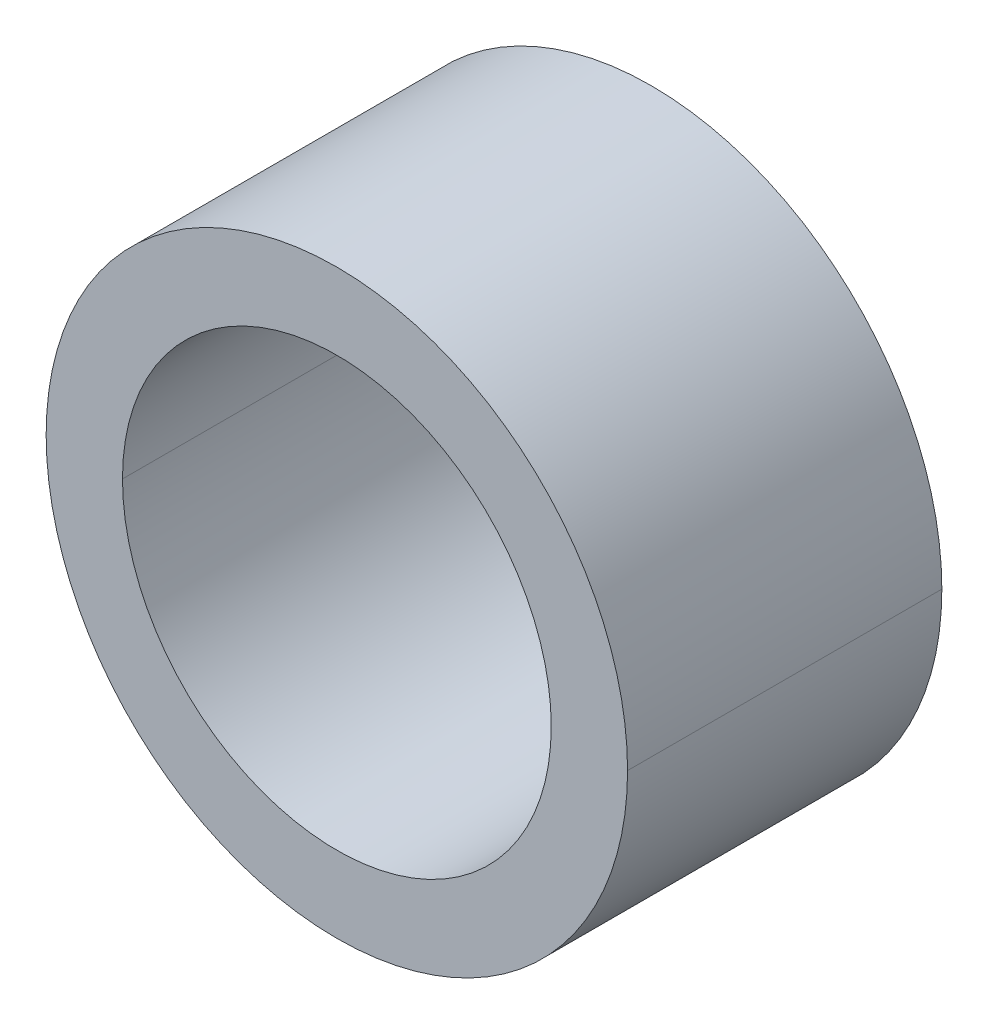
ISO-10303-21;
HEADER;
FILE_DESCRIPTION(('STEP AP214'),'2;1');
FILE_NAME('part.step','',(''),(''),'','','');
FILE_SCHEMA(('AUTOMOTIVE_DESIGN { 1 0 10303 214 1 1 1 1 }'));
ENDSEC;
DATA;
#1=APPLICATION_CONTEXT('core data for automotive mechanical design processes');
#2=APPLICATION_PROTOCOL_DEFINITION('international standard','automotive_design',2000,#1);
#3=PRODUCT_CONTEXT('',#1,'mechanical');
#4=PRODUCT('Part','Part','',(#3));
#5=PRODUCT_RELATED_PRODUCT_CATEGORY('part','',(#4));
#6=PRODUCT_DEFINITION_FORMATION('','',#4);
#7=PRODUCT_DEFINITION_CONTEXT('part definition',#1,'design');
#8=PRODUCT_DEFINITION('design','',#6,#7);
#9=PRODUCT_DEFINITION_SHAPE('','',#8);
#10=(LENGTH_UNIT() NAMED_UNIT(*) SI_UNIT(.MILLI.,.METRE.));
#11=(NAMED_UNIT(*) PLANE_ANGLE_UNIT() SI_UNIT($,.RADIAN.));
#12=(NAMED_UNIT(*) SI_UNIT($,.STERADIAN.) SOLID_ANGLE_UNIT());
#13=UNCERTAINTY_MEASURE_WITH_UNIT(LENGTH_MEASURE(1.E-05),#10,'distance_accuracy_value','');
#14=(GEOMETRIC_REPRESENTATION_CONTEXT(3) GLOBAL_UNCERTAINTY_ASSIGNED_CONTEXT((#13)) GLOBAL_UNIT_ASSIGNED_CONTEXT((#10,
#11,#12)) REPRESENTATION_CONTEXT('',''));
#15=CARTESIAN_POINT('',(0.,0.,0.));
#16=DIRECTION('',(0.,0.,1.));
#17=DIRECTION('',(1.,0.,0.));
#18=AXIS2_PLACEMENT_3D('',#15,#16,#17);
#19=CARTESIAN_POINT('',(0.,0.,7.112));
#20=DIRECTION('',(0.,0.,-1.));
#21=DIRECTION('',(-1.,0.,0.));
#22=AXIS2_PLACEMENT_3D('',#19,#20,#21);
#23=CYLINDRICAL_SURFACE('',#22,4.8514);
#24=DIRECTION('',(0.,0.,-1.));
#25=VECTOR('',#24,1.);
#26=CARTESIAN_POINT('',(4.8514,0.,7.112));
#27=LINE('',#26,#25);
#28=CARTESIAN_POINT('',(4.8514,0.,7.112));
#29=VERTEX_POINT('',#28);
#30=CARTESIAN_POINT('',(4.8514,0.,0.));
#31=VERTEX_POINT('',#30);
#32=EDGE_CURVE('E80',#29,#31,#27,.T.);
#33=ORIENTED_EDGE('',*,*,#32,.F.);
#34=CARTESIAN_POINT('',(0.,0.,7.112));
#35=DIRECTION('',(0.,0.,1.));
#36=DIRECTION('',(1.,0.,0.));
#37=AXIS2_PLACEMENT_3D('',#34,#35,#36);
#38=CIRCLE('',#37,4.8514);
#39=CARTESIAN_POINT('',(-4.8514,0.,7.112));
#40=VERTEX_POINT('',#39);
#41=EDGE_CURVE('E71',#29,#40,#38,.T.);
#42=ORIENTED_EDGE('',*,*,#41,.T.);
#43=DIRECTION('',(0.,0.,-1.));
#44=VECTOR('',#43,1.);
#45=CARTESIAN_POINT('',(-4.8514,0.,7.112));
#46=LINE('',#45,#44);
#47=CARTESIAN_POINT('',(-4.8514,0.,0.));
#48=VERTEX_POINT('',#47);
#49=EDGE_CURVE('E72',#40,#48,#46,.T.);
#50=ORIENTED_EDGE('',*,*,#49,.T.);
#51=CARTESIAN_POINT('',(0.,0.,0.));
#52=DIRECTION('',(0.,0.,1.));
#53=DIRECTION('',(1.,0.,0.));
#54=AXIS2_PLACEMENT_3D('',#51,#52,#53);
#55=CIRCLE('',#54,4.8514);
#56=EDGE_CURVE('E11',#31,#48,#55,.T.);
#57=ORIENTED_EDGE('',*,*,#56,.F.);
#58=EDGE_LOOP('',(#33,#42,#50,#57));
#59=FACE_BOUND('',#58,.T.);
#60=ADVANCED_FACE('F16',(#59),#23,.F.);
#61=CARTESIAN_POINT('',(0.,0.,7.112));
#62=DIRECTION('',(0.,0.,-1.));
#63=DIRECTION('',(-1.,0.,0.));
#64=AXIS2_PLACEMENT_3D('',#61,#62,#63);
#65=CYLINDRICAL_SURFACE('',#64,6.5786);
#66=DIRECTION('',(0.,0.,-1.));
#67=VECTOR('',#66,1.);
#68=CARTESIAN_POINT('',(6.5786,0.,7.112));
#69=LINE('',#68,#67);
#70=CARTESIAN_POINT('',(6.5786,0.,7.112));
#71=VERTEX_POINT('',#70);
#72=CARTESIAN_POINT('',(6.5786,0.,0.));
#73=VERTEX_POINT('',#72);
#74=EDGE_CURVE('E103',#71,#73,#69,.T.);
#75=ORIENTED_EDGE('',*,*,#74,.F.);
#76=CARTESIAN_POINT('',(0.,0.,7.112));
#77=DIRECTION('',(0.,0.,1.));
#78=DIRECTION('',(1.,0.,0.));
#79=AXIS2_PLACEMENT_3D('',#76,#77,#78);
#80=CIRCLE('',#79,6.5786);
#81=CARTESIAN_POINT('',(-6.5786,0.,7.112));
#82=VERTEX_POINT('',#81);
#83=EDGE_CURVE('E19',#82,#71,#80,.T.);
#84=ORIENTED_EDGE('',*,*,#83,.F.);
#85=DIRECTION('',(0.,0.,-1.));
#86=VECTOR('',#85,1.);
#87=CARTESIAN_POINT('',(-6.5786,0.,7.112));
#88=LINE('',#87,#86);
#89=CARTESIAN_POINT('',(-6.5786,0.,0.));
#90=VERTEX_POINT('',#89);
#91=EDGE_CURVE('E113',#82,#90,#88,.T.);
#92=ORIENTED_EDGE('',*,*,#91,.T.);
#93=CARTESIAN_POINT('',(0.,0.,0.));
#94=DIRECTION('',(0.,0.,1.));
#95=DIRECTION('',(1.,0.,0.));
#96=AXIS2_PLACEMENT_3D('',#93,#94,#95);
#97=CIRCLE('',#96,6.5786);
#98=EDGE_CURVE('E25',#90,#73,#97,.T.);
#99=ORIENTED_EDGE('',*,*,#98,.T.);
#100=EDGE_LOOP('',(#75,#84,#92,#99));
#101=FACE_BOUND('',#100,.T.);
#102=ADVANCED_FACE('F121',(#101),#65,.T.);
#103=CARTESIAN_POINT('',(0.,0.,0.));
#104=DIRECTION('',(0.,0.,1.));
#105=DIRECTION('',(1.,0.,0.));
#106=AXIS2_PLACEMENT_3D('',#103,#104,#105);
#107=PLANE('',#106);
#108=CARTESIAN_POINT('',(0.,0.,0.));
#109=DIRECTION('',(0.,0.,1.));
#110=DIRECTION('',(1.,0.,0.));
#111=AXIS2_PLACEMENT_3D('',#108,#109,#110);
#112=CIRCLE('',#111,4.8514);
#113=EDGE_CURVE('E87',#48,#31,#112,.T.);
#114=ORIENTED_EDGE('',*,*,#113,.T.);
#115=ORIENTED_EDGE('',*,*,#56,.T.);
#116=EDGE_LOOP('',(#114,#115));
#117=FACE_BOUND('',#116,.T.);
#118=ORIENTED_EDGE('',*,*,#98,.F.);
#119=CARTESIAN_POINT('',(0.,0.,0.));
#120=DIRECTION('',(0.,0.,1.));
#121=DIRECTION('',(1.,0.,0.));
#122=AXIS2_PLACEMENT_3D('',#119,#120,#121);
#123=CIRCLE('',#122,6.5786);
#124=EDGE_CURVE('E110',#73,#90,#123,.T.);
#125=ORIENTED_EDGE('',*,*,#124,.F.);
#126=EDGE_LOOP('',(#118,#125));
#127=FACE_BOUND('',#126,.T.);
#128=ADVANCED_FACE('F126',(#117,#127),#107,.F.);
#129=CARTESIAN_POINT('',(0.,0.,7.112));
#130=DIRECTION('',(0.,0.,1.));
#131=DIRECTION('',(1.,0.,0.));
#132=AXIS2_PLACEMENT_3D('',#129,#130,#131);
#133=PLANE('',#132);
#134=CARTESIAN_POINT('',(0.,0.,7.112));
#135=DIRECTION('',(0.,0.,1.));
#136=DIRECTION('',(1.,0.,0.));
#137=AXIS2_PLACEMENT_3D('',#134,#135,#136);
#138=CIRCLE('',#137,4.8514);
#139=EDGE_CURVE('E83',#40,#29,#138,.T.);
#140=ORIENTED_EDGE('',*,*,#139,.F.);
#141=ORIENTED_EDGE('',*,*,#41,.F.);
#142=EDGE_LOOP('',(#140,#141));
#143=FACE_BOUND('',#142,.T.);
#144=ORIENTED_EDGE('',*,*,#83,.T.);
#145=CARTESIAN_POINT('',(0.,0.,7.112));
#146=DIRECTION('',(0.,0.,1.));
#147=DIRECTION('',(1.,0.,0.));
#148=AXIS2_PLACEMENT_3D('',#145,#146,#147);
#149=CIRCLE('',#148,6.5786);
#150=EDGE_CURVE('E90',#71,#82,#149,.T.);
#151=ORIENTED_EDGE('',*,*,#150,.T.);
#152=EDGE_LOOP('',(#144,#151));
#153=FACE_BOUND('',#152,.T.);
#154=ADVANCED_FACE('F93',(#143,#153),#133,.T.);
#155=CARTESIAN_POINT('',(0.,0.,7.112));
#156=DIRECTION('',(0.,0.,-1.));
#157=DIRECTION('',(-1.,0.,0.));
#158=AXIS2_PLACEMENT_3D('',#155,#156,#157);
#159=CYLINDRICAL_SURFACE('',#158,6.5786);
#160=ORIENTED_EDGE('',*,*,#150,.F.);
#161=ORIENTED_EDGE('',*,*,#74,.T.);
#162=ORIENTED_EDGE('',*,*,#124,.T.);
#163=ORIENTED_EDGE('',*,*,#91,.F.);
#164=EDGE_LOOP('',(#160,#161,#162,#163));
#165=FACE_BOUND('',#164,.T.);
#166=ADVANCED_FACE('F130',(#165),#159,.T.);
#167=CARTESIAN_POINT('',(0.,0.,7.112));
#168=DIRECTION('',(0.,0.,-1.));
#169=DIRECTION('',(-1.,0.,0.));
#170=AXIS2_PLACEMENT_3D('',#167,#168,#169);
#171=CYLINDRICAL_SURFACE('',#170,4.8514);
#172=ORIENTED_EDGE('',*,*,#139,.T.);
#173=ORIENTED_EDGE('',*,*,#32,.T.);
#174=ORIENTED_EDGE('',*,*,#113,.F.);
#175=ORIENTED_EDGE('',*,*,#49,.F.);
#176=EDGE_LOOP('',(#172,#173,#174,#175));
#177=FACE_BOUND('',#176,.T.);
#178=ADVANCED_FACE('F81',(#177),#171,.F.);
#179=CLOSED_SHELL('',(#60,#102,#128,#154,#166,#178));
#180=MANIFOLD_SOLID_BREP('B1',#179);
#181=ADVANCED_BREP_SHAPE_REPRESENTATION('',(#18,#180),#14);
#182=SHAPE_DEFINITION_REPRESENTATION(#9,#181);
ENDSEC;
END-ISO-10303-21;
